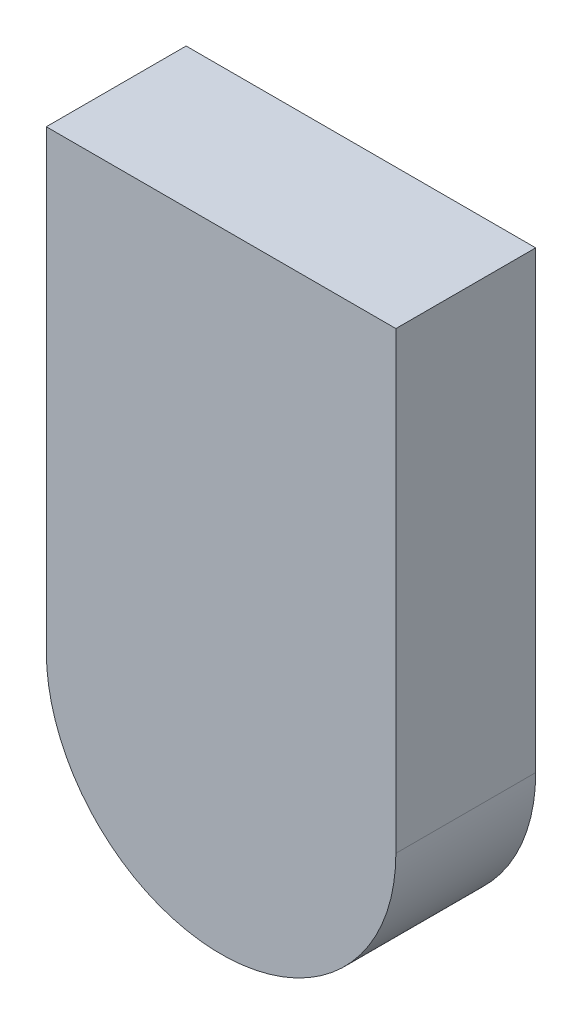
ISO-10303-21;
HEADER;
FILE_DESCRIPTION(('STEP AP214'),'2;1');
FILE_NAME('part.step','',(''),(''),'','','');
FILE_SCHEMA(('AUTOMOTIVE_DESIGN { 1 0 10303 214 1 1 1 1 }'));
ENDSEC;
DATA;
#1=APPLICATION_CONTEXT('core data for automotive mechanical design processes');
#2=APPLICATION_PROTOCOL_DEFINITION('international standard','automotive_design',2000,#1);
#3=PRODUCT_CONTEXT('',#1,'mechanical');
#4=PRODUCT('Part','Part','',(#3));
#5=PRODUCT_RELATED_PRODUCT_CATEGORY('part','',(#4));
#6=PRODUCT_DEFINITION_FORMATION('','',#4);
#7=PRODUCT_DEFINITION_CONTEXT('part definition',#1,'design');
#8=PRODUCT_DEFINITION('design','',#6,#7);
#9=PRODUCT_DEFINITION_SHAPE('','',#8);
#10=(LENGTH_UNIT() NAMED_UNIT(*) SI_UNIT(.MILLI.,.METRE.));
#11=(NAMED_UNIT(*) PLANE_ANGLE_UNIT() SI_UNIT($,.RADIAN.));
#12=(NAMED_UNIT(*) SI_UNIT($,.STERADIAN.) SOLID_ANGLE_UNIT());
#13=UNCERTAINTY_MEASURE_WITH_UNIT(LENGTH_MEASURE(1.E-05),#10,'distance_accuracy_value','');
#14=(GEOMETRIC_REPRESENTATION_CONTEXT(3) GLOBAL_UNCERTAINTY_ASSIGNED_CONTEXT((#13)) GLOBAL_UNIT_ASSIGNED_CONTEXT((#10,
#11,#12)) REPRESENTATION_CONTEXT('',''));
#15=CARTESIAN_POINT('',(0.,0.,0.));
#16=DIRECTION('',(0.,0.,1.));
#17=DIRECTION('',(1.,0.,0.));
#18=AXIS2_PLACEMENT_3D('',#15,#16,#17);
#19=CARTESIAN_POINT('',(0.625,2.05,0.));
#20=DIRECTION('',(0.,1.,0.));
#21=DIRECTION('',(1.,0.,0.));
#22=AXIS2_PLACEMENT_3D('',#19,#20,#21);
#23=PLANE('',#22);
#24=DIRECTION('',(0.,0.,1.));
#25=VECTOR('',#24,1.);
#26=CARTESIAN_POINT('',(0.625,2.05,0.));
#27=LINE('',#26,#25);
#28=CARTESIAN_POINT('',(0.625,2.05,0.));
#29=VERTEX_POINT('',#28);
#30=CARTESIAN_POINT('',(0.625,2.05,0.1));
#31=VERTEX_POINT('',#30);
#32=EDGE_CURVE('E11',#29,#31,#27,.T.);
#33=ORIENTED_EDGE('',*,*,#32,.T.);
#34=DIRECTION('',(1.,0.,0.));
#35=VECTOR('',#34,1.);
#36=CARTESIAN_POINT('',(0.625,2.05,0.1));
#37=LINE('',#36,#35);
#38=CARTESIAN_POINT('',(0.875,2.05,0.1));
#39=VERTEX_POINT('',#38);
#40=EDGE_CURVE('E24',#31,#39,#37,.T.);
#41=ORIENTED_EDGE('',*,*,#40,.T.);
#42=DIRECTION('',(0.,0.,1.));
#43=VECTOR('',#42,1.);
#44=CARTESIAN_POINT('',(0.875,2.05,0.));
#45=LINE('',#44,#43);
#46=CARTESIAN_POINT('',(0.875,2.05,0.));
#47=VERTEX_POINT('',#46);
#48=EDGE_CURVE('E85',#47,#39,#45,.T.);
#49=ORIENTED_EDGE('',*,*,#48,.F.);
#50=DIRECTION('',(1.,0.,0.));
#51=VECTOR('',#50,1.);
#52=CARTESIAN_POINT('',(0.625,2.05,0.));
#53=LINE('',#52,#51);
#54=EDGE_CURVE('E82',#29,#47,#53,.T.);
#55=ORIENTED_EDGE('',*,*,#54,.F.);
#56=EDGE_LOOP('',(#33,#41,#49,#55));
#57=FACE_BOUND('',#56,.T.);
#58=ADVANCED_FACE('F17',(#57),#23,.T.);
#59=CARTESIAN_POINT('',(0.875,2.05,0.));
#60=DIRECTION('',(1.,0.,0.));
#61=DIRECTION('',(0.,-1.,0.));
#62=AXIS2_PLACEMENT_3D('',#59,#60,#61);
#63=PLANE('',#62);
#64=ORIENTED_EDGE('',*,*,#48,.T.);
#65=DIRECTION('',(0.,-1.,0.));
#66=VECTOR('',#65,1.);
#67=CARTESIAN_POINT('',(0.875,2.05,0.1));
#68=LINE('',#67,#66);
#69=CARTESIAN_POINT('',(0.875,1.725,0.1));
#70=VERTEX_POINT('',#69);
#71=EDGE_CURVE('E80',#39,#70,#68,.T.);
#72=ORIENTED_EDGE('',*,*,#71,.T.);
#73=DIRECTION('',(0.,0.,1.));
#74=VECTOR('',#73,1.);
#75=CARTESIAN_POINT('',(0.875,1.725,0.));
#76=LINE('',#75,#74);
#77=CARTESIAN_POINT('',(0.875,1.725,0.));
#78=VERTEX_POINT('',#77);
#79=EDGE_CURVE('E60',#78,#70,#76,.T.);
#80=ORIENTED_EDGE('',*,*,#79,.F.);
#81=DIRECTION('',(0.,-1.,0.));
#82=VECTOR('',#81,1.);
#83=CARTESIAN_POINT('',(0.875,2.05,0.));
#84=LINE('',#83,#82);
#85=EDGE_CURVE('E76',#47,#78,#84,.T.);
#86=ORIENTED_EDGE('',*,*,#85,.F.);
#87=EDGE_LOOP('',(#64,#72,#80,#86));
#88=FACE_BOUND('',#87,.T.);
#89=ADVANCED_FACE('F89',(#88),#63,.T.);
#90=CARTESIAN_POINT('',(0.75,1.725,0.));
#91=DIRECTION('',(0.,0.,-1.));
#92=DIRECTION('',(1.,0.,0.));
#93=AXIS2_PLACEMENT_3D('',#90,#91,#92);
#94=CYLINDRICAL_SURFACE('',#93,0.125);
#95=CARTESIAN_POINT('',(0.75,1.725,0.));
#96=DIRECTION('',(0.,0.,1.));
#97=DIRECTION('',(1.,0.,0.));
#98=AXIS2_PLACEMENT_3D('',#95,#96,#97);
#99=CIRCLE('',#98,0.125);
#100=CARTESIAN_POINT('',(0.625,1.725,0.));
#101=VERTEX_POINT('',#100);
#102=EDGE_CURVE('E64',#101,#78,#99,.T.);
#103=ORIENTED_EDGE('',*,*,#102,.T.);
#104=ORIENTED_EDGE('',*,*,#79,.T.);
#105=CARTESIAN_POINT('',(0.75,1.725,0.1));
#106=DIRECTION('',(0.,0.,1.));
#107=DIRECTION('',(1.,0.,0.));
#108=AXIS2_PLACEMENT_3D('',#105,#106,#107);
#109=CIRCLE('',#108,0.125);
#110=CARTESIAN_POINT('',(0.625,1.725,0.1));
#111=VERTEX_POINT('',#110);
#112=EDGE_CURVE('E55',#111,#70,#109,.T.);
#113=ORIENTED_EDGE('',*,*,#112,.F.);
#114=DIRECTION('',(0.,0.,1.));
#115=VECTOR('',#114,1.);
#116=CARTESIAN_POINT('',(0.625,1.725,0.));
#117=LINE('',#116,#115);
#118=EDGE_CURVE('E59',#101,#111,#117,.T.);
#119=ORIENTED_EDGE('',*,*,#118,.F.);
#120=EDGE_LOOP('',(#103,#104,#113,#119));
#121=FACE_BOUND('',#120,.T.);
#122=ADVANCED_FACE('F58',(#121),#94,.T.);
#123=CARTESIAN_POINT('',(0.625,2.05,0.));
#124=DIRECTION('',(1.,0.,0.));
#125=DIRECTION('',(0.,-1.,0.));
#126=AXIS2_PLACEMENT_3D('',#123,#124,#125);
#127=PLANE('',#126);
#128=DIRECTION('',(0.,-1.,0.));
#129=VECTOR('',#128,1.);
#130=CARTESIAN_POINT('',(0.625,2.05,0.));
#131=LINE('',#130,#129);
#132=EDGE_CURVE('E69',#29,#101,#131,.T.);
#133=ORIENTED_EDGE('',*,*,#132,.T.);
#134=ORIENTED_EDGE('',*,*,#118,.T.);
#135=DIRECTION('',(0.,-1.,0.));
#136=VECTOR('',#135,1.);
#137=CARTESIAN_POINT('',(0.625,2.05,0.1));
#138=LINE('',#137,#136);
#139=EDGE_CURVE('E67',#31,#111,#138,.T.);
#140=ORIENTED_EDGE('',*,*,#139,.F.);
#141=ORIENTED_EDGE('',*,*,#32,.F.);
#142=EDGE_LOOP('',(#133,#134,#140,#141));
#143=FACE_BOUND('',#142,.T.);
#144=ADVANCED_FACE('F66',(#143),#127,.F.);
#145=CARTESIAN_POINT('',(0.75,1.850342514613,0.));
#146=DIRECTION('',(0.,0.,-1.));
#147=DIRECTION('',(-1.,0.,0.));
#148=AXIS2_PLACEMENT_3D('',#145,#146,#147);
#149=PLANE('',#148);
#150=ORIENTED_EDGE('',*,*,#54,.T.);
#151=ORIENTED_EDGE('',*,*,#85,.T.);
#152=ORIENTED_EDGE('',*,*,#102,.F.);
#153=ORIENTED_EDGE('',*,*,#132,.F.);
#154=EDGE_LOOP('',(#150,#151,#152,#153));
#155=FACE_BOUND('',#154,.T.);
#156=ADVANCED_FACE('F91',(#155),#149,.T.);
#157=CARTESIAN_POINT('',(0.75,1.850342514613,0.1));
#158=DIRECTION('',(0.,0.,-1.));
#159=DIRECTION('',(-1.,0.,0.));
#160=AXIS2_PLACEMENT_3D('',#157,#158,#159);
#161=PLANE('',#160);
#162=ORIENTED_EDGE('',*,*,#139,.T.);
#163=ORIENTED_EDGE('',*,*,#112,.T.);
#164=ORIENTED_EDGE('',*,*,#71,.F.);
#165=ORIENTED_EDGE('',*,*,#40,.F.);
#166=EDGE_LOOP('',(#162,#163,#164,#165));
#167=FACE_BOUND('',#166,.T.);
#168=ADVANCED_FACE('F71',(#167),#161,.F.);
#169=CLOSED_SHELL('',(#58,#89,#122,#144,#156,#168));
#170=MANIFOLD_SOLID_BREP('B1',#169);
#171=ADVANCED_BREP_SHAPE_REPRESENTATION('',(#18,#170),#14);
#172=SHAPE_DEFINITION_REPRESENTATION(#9,#171);
ENDSEC;
END-ISO-10303-21;
